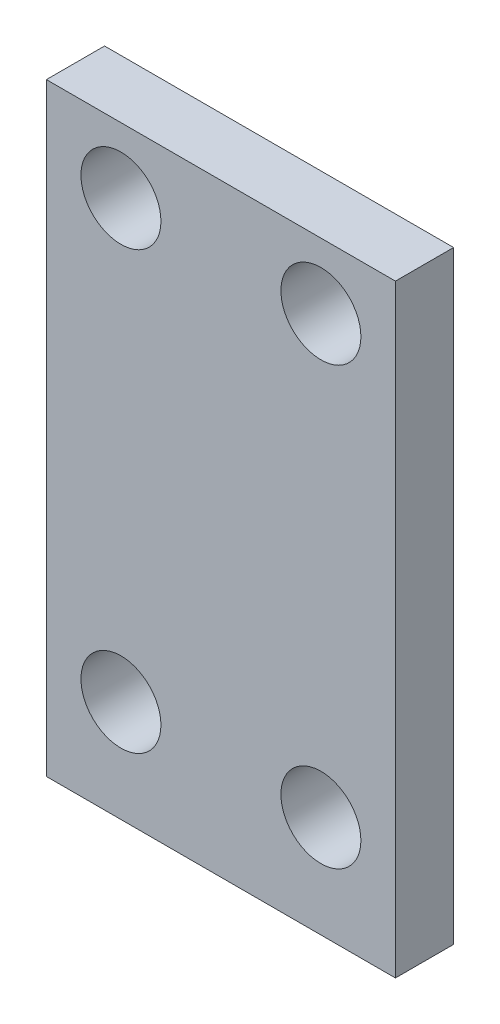
ISO-10303-21;
HEADER;
FILE_DESCRIPTION(('STEP AP214'),'2;1');
FILE_NAME('part.step','',(''),(''),'','','');
FILE_SCHEMA(('AUTOMOTIVE_DESIGN { 1 0 10303 214 1 1 1 1 }'));
ENDSEC;
DATA;
#1=APPLICATION_CONTEXT('core data for automotive mechanical design processes');
#2=APPLICATION_PROTOCOL_DEFINITION('international standard','automotive_design',2000,#1);
#3=PRODUCT_CONTEXT('',#1,'mechanical');
#4=PRODUCT('Part','Part','',(#3));
#5=PRODUCT_RELATED_PRODUCT_CATEGORY('part','',(#4));
#6=PRODUCT_DEFINITION_FORMATION('','',#4);
#7=PRODUCT_DEFINITION_CONTEXT('part definition',#1,'design');
#8=PRODUCT_DEFINITION('design','',#6,#7);
#9=PRODUCT_DEFINITION_SHAPE('','',#8);
#10=(LENGTH_UNIT() NAMED_UNIT(*) SI_UNIT(.MILLI.,.METRE.));
#11=(NAMED_UNIT(*) PLANE_ANGLE_UNIT() SI_UNIT($,.RADIAN.));
#12=(NAMED_UNIT(*) SI_UNIT($,.STERADIAN.) SOLID_ANGLE_UNIT());
#13=UNCERTAINTY_MEASURE_WITH_UNIT(LENGTH_MEASURE(1.E-05),#10,'distance_accuracy_value','');
#14=(GEOMETRIC_REPRESENTATION_CONTEXT(3) GLOBAL_UNCERTAINTY_ASSIGNED_CONTEXT((#13)) GLOBAL_UNIT_ASSIGNED_CONTEXT((#10,
#11,#12)) REPRESENTATION_CONTEXT('',''));
#15=CARTESIAN_POINT('',(0.,0.,0.));
#16=DIRECTION('',(0.,0.,1.));
#17=DIRECTION('',(1.,0.,0.));
#18=AXIS2_PLACEMENT_3D('',#15,#16,#17);
#19=CARTESIAN_POINT('',(0.,0.,1.6));
#20=DIRECTION('',(0.,0.,-1.));
#21=DIRECTION('',(-1.,0.,0.));
#22=AXIS2_PLACEMENT_3D('',#19,#20,#21);
#23=PLANE('',#22);
#24=DIRECTION('',(0.,-1.,0.));
#25=VECTOR('',#24,1.);
#26=CARTESIAN_POINT('',(0.2,3.2,1.6));
#27=LINE('',#26,#25);
#28=CARTESIAN_POINT('',(0.2,19.8,1.6));
#29=VERTEX_POINT('',#28);
#30=CARTESIAN_POINT('',(0.2,3.2,1.6));
#31=VERTEX_POINT('',#30);
#32=EDGE_CURVE('E92',#29,#31,#27,.T.);
#33=ORIENTED_EDGE('',*,*,#32,.T.);
#34=DIRECTION('',(1.,0.,0.));
#35=VECTOR('',#34,1.);
#36=CARTESIAN_POINT('',(0.2,3.2,1.6));
#37=LINE('',#36,#35);
#38=CARTESIAN_POINT('',(9.8,3.2,1.6));
#39=VERTEX_POINT('',#38);
#40=EDGE_CURVE('E87',#31,#39,#37,.T.);
#41=ORIENTED_EDGE('',*,*,#40,.T.);
#42=DIRECTION('',(0.,1.,0.));
#43=VECTOR('',#42,1.);
#44=CARTESIAN_POINT('',(9.8,3.2,1.6));
#45=LINE('',#44,#43);
#46=CARTESIAN_POINT('',(9.8,19.8,1.6));
#47=VERTEX_POINT('',#46);
#48=EDGE_CURVE('E90',#39,#47,#45,.T.);
#49=ORIENTED_EDGE('',*,*,#48,.T.);
#50=DIRECTION('',(-1.,0.,0.));
#51=VECTOR('',#50,1.);
#52=CARTESIAN_POINT('',(0.2,19.8,1.6));
#53=LINE('',#52,#51);
#54=EDGE_CURVE('E57',#47,#29,#53,.T.);
#55=ORIENTED_EDGE('',*,*,#54,.T.);
#56=EDGE_LOOP('',(#33,#41,#49,#55));
#57=FACE_BOUND('',#56,.T.);
#58=CARTESIAN_POINT('',(2.25,6.,1.6));
#59=DIRECTION('',(0.,0.,1.));
#60=DIRECTION('',(1.,0.,0.));
#61=AXIS2_PLACEMENT_3D('',#58,#59,#60);
#62=CIRCLE('',#61,1.1);
#63=CARTESIAN_POINT('',(3.35,6.,1.6));
#64=VERTEX_POINT('',#63);
#65=EDGE_CURVE('E112',#64,#64,#62,.T.);
#66=ORIENTED_EDGE('',*,*,#65,.F.);
#67=EDGE_LOOP('',(#66));
#68=FACE_BOUND('',#67,.T.);
#69=CARTESIAN_POINT('',(2.25,18.,1.6));
#70=DIRECTION('',(0.,0.,1.));
#71=DIRECTION('',(1.,0.,0.));
#72=AXIS2_PLACEMENT_3D('',#69,#70,#71);
#73=CIRCLE('',#72,1.1);
#74=CARTESIAN_POINT('',(3.35,18.,1.6));
#75=VERTEX_POINT('',#74);
#76=EDGE_CURVE('E134',#75,#75,#73,.T.);
#77=ORIENTED_EDGE('',*,*,#76,.F.);
#78=EDGE_LOOP('',(#77));
#79=FACE_BOUND('',#78,.T.);
#80=CARTESIAN_POINT('',(7.75,18.,1.6));
#81=DIRECTION('',(0.,0.,1.));
#82=DIRECTION('',(1.,0.,0.));
#83=AXIS2_PLACEMENT_3D('',#80,#81,#82);
#84=CIRCLE('',#83,1.1);
#85=CARTESIAN_POINT('',(8.85,18.,1.6));
#86=VERTEX_POINT('',#85);
#87=EDGE_CURVE('E142',#86,#86,#84,.T.);
#88=ORIENTED_EDGE('',*,*,#87,.F.);
#89=EDGE_LOOP('',(#88));
#90=FACE_BOUND('',#89,.T.);
#91=CARTESIAN_POINT('',(7.75,6.,1.6));
#92=DIRECTION('',(0.,0.,1.));
#93=DIRECTION('',(1.,0.,0.));
#94=AXIS2_PLACEMENT_3D('',#91,#92,#93);
#95=CIRCLE('',#94,1.1);
#96=CARTESIAN_POINT('',(8.85,6.,1.6));
#97=VERTEX_POINT('',#96);
#98=EDGE_CURVE('E150',#97,#97,#95,.T.);
#99=ORIENTED_EDGE('',*,*,#98,.F.);
#100=EDGE_LOOP('',(#99));
#101=FACE_BOUND('',#100,.T.);
#102=ADVANCED_FACE('F39',(#57,#68,#79,#90,#101),#23,.F.);
#103=CARTESIAN_POINT('',(0.,0.,0.));
#104=DIRECTION('',(0.,0.,-1.));
#105=DIRECTION('',(-1.,0.,0.));
#106=AXIS2_PLACEMENT_3D('',#103,#104,#105);
#107=PLANE('',#106);
#108=CARTESIAN_POINT('',(7.75,18.,0.));
#109=DIRECTION('',(0.,0.,1.));
#110=DIRECTION('',(1.,0.,0.));
#111=AXIS2_PLACEMENT_3D('',#108,#109,#110);
#112=CIRCLE('',#111,1.1);
#113=CARTESIAN_POINT('',(8.85,18.,0.));
#114=VERTEX_POINT('',#113);
#115=EDGE_CURVE('E146',#114,#114,#112,.T.);
#116=ORIENTED_EDGE('',*,*,#115,.T.);
#117=EDGE_LOOP('',(#116));
#118=FACE_BOUND('',#117,.T.);
#119=CARTESIAN_POINT('',(2.25,6.,0.));
#120=DIRECTION('',(0.,0.,1.));
#121=DIRECTION('',(1.,0.,0.));
#122=AXIS2_PLACEMENT_3D('',#119,#120,#121);
#123=CIRCLE('',#122,1.1);
#124=CARTESIAN_POINT('',(3.35,6.,0.));
#125=VERTEX_POINT('',#124);
#126=EDGE_CURVE('E130',#125,#125,#123,.T.);
#127=ORIENTED_EDGE('',*,*,#126,.T.);
#128=EDGE_LOOP('',(#127));
#129=FACE_BOUND('',#128,.T.);
#130=DIRECTION('',(0.,-1.,0.));
#131=VECTOR('',#130,1.);
#132=CARTESIAN_POINT('',(0.2,3.2,0.));
#133=LINE('',#132,#131);
#134=CARTESIAN_POINT('',(0.2,19.8,0.));
#135=VERTEX_POINT('',#134);
#136=CARTESIAN_POINT('',(0.2,3.2,0.));
#137=VERTEX_POINT('',#136);
#138=EDGE_CURVE('E108',#135,#137,#133,.T.);
#139=ORIENTED_EDGE('',*,*,#138,.F.);
#140=DIRECTION('',(-1.,0.,0.));
#141=VECTOR('',#140,1.);
#142=CARTESIAN_POINT('',(0.2,19.8,0.));
#143=LINE('',#142,#141);
#144=CARTESIAN_POINT('',(9.8,19.8,0.));
#145=VERTEX_POINT('',#144);
#146=EDGE_CURVE('E80',#145,#135,#143,.T.);
#147=ORIENTED_EDGE('',*,*,#146,.F.);
#148=DIRECTION('',(0.,1.,0.));
#149=VECTOR('',#148,1.);
#150=CARTESIAN_POINT('',(9.8,3.2,0.));
#151=LINE('',#150,#149);
#152=CARTESIAN_POINT('',(9.8,3.2,0.));
#153=VERTEX_POINT('',#152);
#154=EDGE_CURVE('E74',#153,#145,#151,.T.);
#155=ORIENTED_EDGE('',*,*,#154,.F.);
#156=DIRECTION('',(1.,0.,0.));
#157=VECTOR('',#156,1.);
#158=CARTESIAN_POINT('',(0.2,3.2,0.));
#159=LINE('',#158,#157);
#160=EDGE_CURVE('E97',#137,#153,#159,.T.);
#161=ORIENTED_EDGE('',*,*,#160,.F.);
#162=EDGE_LOOP('',(#139,#147,#155,#161));
#163=FACE_BOUND('',#162,.T.);
#164=CARTESIAN_POINT('',(2.25,18.,0.));
#165=DIRECTION('',(0.,0.,1.));
#166=DIRECTION('',(1.,0.,0.));
#167=AXIS2_PLACEMENT_3D('',#164,#165,#166);
#168=CIRCLE('',#167,1.1);
#169=CARTESIAN_POINT('',(3.35,18.,0.));
#170=VERTEX_POINT('',#169);
#171=EDGE_CURVE('E138',#170,#170,#168,.T.);
#172=ORIENTED_EDGE('',*,*,#171,.T.);
#173=EDGE_LOOP('',(#172));
#174=FACE_BOUND('',#173,.T.);
#175=CARTESIAN_POINT('',(7.75,6.,0.));
#176=DIRECTION('',(0.,0.,1.));
#177=DIRECTION('',(1.,0.,0.));
#178=AXIS2_PLACEMENT_3D('',#175,#176,#177);
#179=CIRCLE('',#178,1.1);
#180=CARTESIAN_POINT('',(8.85,6.,0.));
#181=VERTEX_POINT('',#180);
#182=EDGE_CURVE('E154',#181,#181,#179,.T.);
#183=ORIENTED_EDGE('',*,*,#182,.T.);
#184=EDGE_LOOP('',(#183));
#185=FACE_BOUND('',#184,.T.);
#186=ADVANCED_FACE('F125',(#118,#129,#163,#174,#185),#107,.T.);
#187=CARTESIAN_POINT('',(0.2,3.2,1.6));
#188=DIRECTION('',(1.,0.,0.));
#189=DIRECTION('',(0.,0.,-1.));
#190=AXIS2_PLACEMENT_3D('',#187,#188,#189);
#191=PLANE('',#190);
#192=ORIENTED_EDGE('',*,*,#138,.T.);
#193=DIRECTION('',(0.,0.,-1.));
#194=VECTOR('',#193,1.);
#195=CARTESIAN_POINT('',(0.2,3.2,1.6));
#196=LINE('',#195,#194);
#197=EDGE_CURVE('E11',#31,#137,#196,.T.);
#198=ORIENTED_EDGE('',*,*,#197,.F.);
#199=ORIENTED_EDGE('',*,*,#32,.F.);
#200=DIRECTION('',(0.,0.,-1.));
#201=VECTOR('',#200,1.);
#202=CARTESIAN_POINT('',(0.2,19.8,1.6));
#203=LINE('',#202,#201);
#204=EDGE_CURVE('E104',#29,#135,#203,.T.);
#205=ORIENTED_EDGE('',*,*,#204,.T.);
#206=EDGE_LOOP('',(#192,#198,#199,#205));
#207=FACE_BOUND('',#206,.T.);
#208=ADVANCED_FACE('F41',(#207),#191,.F.);
#209=CARTESIAN_POINT('',(0.2,3.2,1.6));
#210=DIRECTION('',(0.,1.,0.));
#211=DIRECTION('',(0.,0.,1.));
#212=AXIS2_PLACEMENT_3D('',#209,#210,#211);
#213=PLANE('',#212);
#214=ORIENTED_EDGE('',*,*,#160,.T.);
#215=DIRECTION('',(0.,0.,-1.));
#216=VECTOR('',#215,1.);
#217=CARTESIAN_POINT('',(9.8,3.2,1.6));
#218=LINE('',#217,#216);
#219=EDGE_CURVE('E49',#39,#153,#218,.T.);
#220=ORIENTED_EDGE('',*,*,#219,.F.);
#221=ORIENTED_EDGE('',*,*,#40,.F.);
#222=ORIENTED_EDGE('',*,*,#197,.T.);
#223=EDGE_LOOP('',(#214,#220,#221,#222));
#224=FACE_BOUND('',#223,.T.);
#225=ADVANCED_FACE('F96',(#224),#213,.F.);
#226=CARTESIAN_POINT('',(9.8,3.2,1.6));
#227=DIRECTION('',(-1.,0.,0.));
#228=DIRECTION('',(0.,0.,1.));
#229=AXIS2_PLACEMENT_3D('',#226,#227,#228);
#230=PLANE('',#229);
#231=ORIENTED_EDGE('',*,*,#154,.T.);
#232=DIRECTION('',(0.,0.,-1.));
#233=VECTOR('',#232,1.);
#234=CARTESIAN_POINT('',(9.8,19.8,1.6));
#235=LINE('',#234,#233);
#236=EDGE_CURVE('E99',#47,#145,#235,.T.);
#237=ORIENTED_EDGE('',*,*,#236,.F.);
#238=ORIENTED_EDGE('',*,*,#48,.F.);
#239=ORIENTED_EDGE('',*,*,#219,.T.);
#240=EDGE_LOOP('',(#231,#237,#238,#239));
#241=FACE_BOUND('',#240,.T.);
#242=ADVANCED_FACE('F100',(#241),#230,.F.);
#243=CARTESIAN_POINT('',(0.2,19.8,1.6));
#244=DIRECTION('',(0.,-1.,0.));
#245=DIRECTION('',(0.,0.,-1.));
#246=AXIS2_PLACEMENT_3D('',#243,#244,#245);
#247=PLANE('',#246);
#248=ORIENTED_EDGE('',*,*,#146,.T.);
#249=ORIENTED_EDGE('',*,*,#204,.F.);
#250=ORIENTED_EDGE('',*,*,#54,.F.);
#251=ORIENTED_EDGE('',*,*,#236,.T.);
#252=EDGE_LOOP('',(#248,#249,#250,#251));
#253=FACE_BOUND('',#252,.T.);
#254=ADVANCED_FACE('F122',(#253),#247,.F.);
#255=CARTESIAN_POINT('',(2.25,6.,1.6));
#256=DIRECTION('',(0.,0.,-1.));
#257=DIRECTION('',(-1.,0.,0.));
#258=AXIS2_PLACEMENT_3D('',#255,#256,#257);
#259=CYLINDRICAL_SURFACE('',#258,1.1);
#260=ORIENTED_EDGE('',*,*,#65,.T.);
#261=EDGE_LOOP('',(#260));
#262=FACE_BOUND('',#261,.T.);
#263=ORIENTED_EDGE('',*,*,#126,.F.);
#264=EDGE_LOOP('',(#263));
#265=FACE_BOUND('',#264,.T.);
#266=ADVANCED_FACE('F173',(#262,#265),#259,.F.);
#267=CARTESIAN_POINT('',(2.25,18.,1.6));
#268=DIRECTION('',(0.,0.,-1.));
#269=DIRECTION('',(-1.,0.,0.));
#270=AXIS2_PLACEMENT_3D('',#267,#268,#269);
#271=CYLINDRICAL_SURFACE('',#270,1.1);
#272=ORIENTED_EDGE('',*,*,#76,.T.);
#273=EDGE_LOOP('',(#272));
#274=FACE_BOUND('',#273,.T.);
#275=ORIENTED_EDGE('',*,*,#171,.F.);
#276=EDGE_LOOP('',(#275));
#277=FACE_BOUND('',#276,.T.);
#278=ADVANCED_FACE('F219',(#274,#277),#271,.F.);
#279=CARTESIAN_POINT('',(7.75,18.,1.6));
#280=DIRECTION('',(0.,0.,-1.));
#281=DIRECTION('',(-1.,0.,0.));
#282=AXIS2_PLACEMENT_3D('',#279,#280,#281);
#283=CYLINDRICAL_SURFACE('',#282,1.1);
#284=ORIENTED_EDGE('',*,*,#87,.T.);
#285=EDGE_LOOP('',(#284));
#286=FACE_BOUND('',#285,.T.);
#287=ORIENTED_EDGE('',*,*,#115,.F.);
#288=EDGE_LOOP('',(#287));
#289=FACE_BOUND('',#288,.T.);
#290=ADVANCED_FACE('F227',(#286,#289),#283,.F.);
#291=CARTESIAN_POINT('',(7.75,6.,1.6));
#292=DIRECTION('',(0.,0.,-1.));
#293=DIRECTION('',(-1.,0.,0.));
#294=AXIS2_PLACEMENT_3D('',#291,#292,#293);
#295=CYLINDRICAL_SURFACE('',#294,1.1);
#296=ORIENTED_EDGE('',*,*,#98,.T.);
#297=EDGE_LOOP('',(#296));
#298=FACE_BOUND('',#297,.T.);
#299=ORIENTED_EDGE('',*,*,#182,.F.);
#300=EDGE_LOOP('',(#299));
#301=FACE_BOUND('',#300,.T.);
#302=ADVANCED_FACE('F162',(#298,#301),#295,.F.);
#303=CLOSED_SHELL('',(#102,#186,#208,#225,#242,#254,#266,#278,#290,#302));
#304=MANIFOLD_SOLID_BREP('B2',#303);
#305=ADVANCED_BREP_SHAPE_REPRESENTATION('',(#18,#304),#14);
#306=SHAPE_DEFINITION_REPRESENTATION(#9,#305);
ENDSEC;
END-ISO-10303-21;
